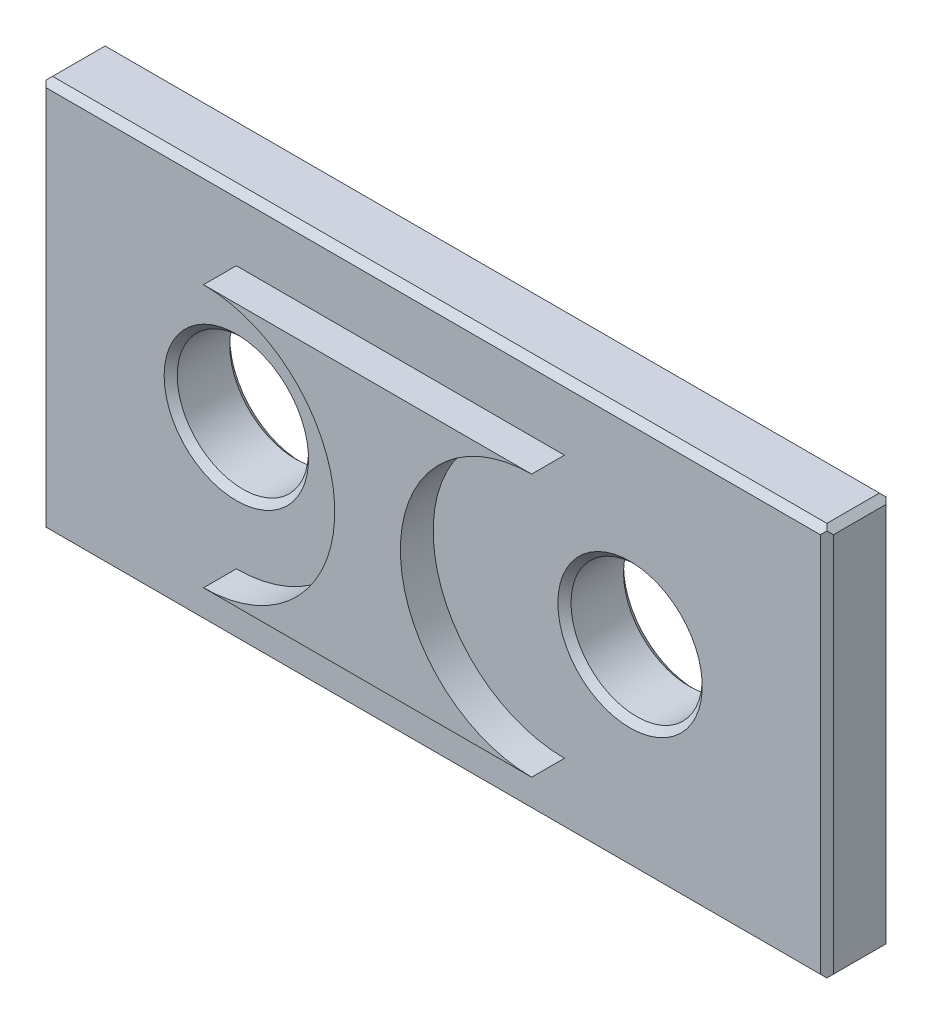
ISO-10303-21;
HEADER;
FILE_DESCRIPTION(('STEP AP214'),'2;1');
FILE_NAME('part.step','',(''),(''),'','','');
FILE_SCHEMA(('AUTOMOTIVE_DESIGN { 1 0 10303 214 1 1 1 1 }'));
ENDSEC;
DATA;
#1=APPLICATION_CONTEXT('core data for automotive mechanical design processes');
#2=APPLICATION_PROTOCOL_DEFINITION('international standard','automotive_design',2000,#1);
#3=PRODUCT_CONTEXT('',#1,'mechanical');
#4=PRODUCT('Part','Part','',(#3));
#5=PRODUCT_RELATED_PRODUCT_CATEGORY('part','',(#4));
#6=PRODUCT_DEFINITION_FORMATION('','',#4);
#7=PRODUCT_DEFINITION_CONTEXT('part definition',#1,'design');
#8=PRODUCT_DEFINITION('design','',#6,#7);
#9=PRODUCT_DEFINITION_SHAPE('','',#8);
#10=(LENGTH_UNIT() NAMED_UNIT(*) SI_UNIT(.MILLI.,.METRE.));
#11=(NAMED_UNIT(*) PLANE_ANGLE_UNIT() SI_UNIT($,.RADIAN.));
#12=(NAMED_UNIT(*) SI_UNIT($,.STERADIAN.) SOLID_ANGLE_UNIT());
#13=UNCERTAINTY_MEASURE_WITH_UNIT(LENGTH_MEASURE(1.E-05),#10,'distance_accuracy_value','');
#14=(GEOMETRIC_REPRESENTATION_CONTEXT(3) GLOBAL_UNCERTAINTY_ASSIGNED_CONTEXT((#13)) GLOBAL_UNIT_ASSIGNED_CONTEXT((#10,
#11,#12)) REPRESENTATION_CONTEXT('',''));
#15=CARTESIAN_POINT('',(0.,0.,0.));
#16=DIRECTION('',(0.,0.,1.));
#17=DIRECTION('',(1.,0.,0.));
#18=AXIS2_PLACEMENT_3D('',#15,#16,#17);
#19=CARTESIAN_POINT('',(0.,60.,10.));
#20=DIRECTION('',(0.,0.,-1.));
#21=DIRECTION('',(-1.,0.,0.));
#22=AXIS2_PLACEMENT_3D('',#19,#20,#21);
#23=PLANE('',#22);
#24=CARTESIAN_POINT('',(30.,30.,10.));
#25=DIRECTION('',(0.,0.,-1.));
#26=DIRECTION('',(-1.,0.,0.));
#27=AXIS2_PLACEMENT_3D('',#24,#25,#26);
#28=CIRCLE('',#27,11.);
#29=CARTESIAN_POINT('',(19.,30.,10.));
#30=VERTEX_POINT('',#29);
#31=EDGE_CURVE('E536',#30,#30,#28,.T.);
#32=ORIENTED_EDGE('',*,*,#31,.T.);
#33=EDGE_LOOP('',(#32));
#34=FACE_BOUND('',#33,.T.);
#35=DIRECTION('',(0.,1.,0.));
#36=VECTOR('',#35,1.);
#37=CARTESIAN_POINT('',(119.,60.,10.));
#38=LINE('',#37,#36);
#39=CARTESIAN_POINT('',(119.,1.,10.));
#40=VERTEX_POINT('',#39);
#41=CARTESIAN_POINT('',(119.,59.,10.));
#42=VERTEX_POINT('',#41);
#43=EDGE_CURVE('E544',#40,#42,#38,.T.);
#44=ORIENTED_EDGE('',*,*,#43,.T.);
#45=DIRECTION('',(-1.,0.,0.));
#46=VECTOR('',#45,1.);
#47=CARTESIAN_POINT('',(0.,59.,10.));
#48=LINE('',#47,#46);
#49=CARTESIAN_POINT('',(0.999999999999999,59.,10.));
#50=VERTEX_POINT('',#49);
#51=EDGE_CURVE('E546',#42,#50,#48,.T.);
#52=ORIENTED_EDGE('',*,*,#51,.T.);
#53=DIRECTION('',(0.,-1.,0.));
#54=VECTOR('',#53,1.);
#55=CARTESIAN_POINT('',(0.999999999999999,60.,10.));
#56=LINE('',#55,#54);
#57=CARTESIAN_POINT('',(0.999999999999999,1.,10.));
#58=VERTEX_POINT('',#57);
#59=EDGE_CURVE('E539',#50,#58,#56,.T.);
#60=ORIENTED_EDGE('',*,*,#59,.T.);
#61=DIRECTION('',(1.,0.,0.));
#62=VECTOR('',#61,1.);
#63=CARTESIAN_POINT('',(0.,1.,10.));
#64=LINE('',#63,#62);
#65=EDGE_CURVE('E542',#58,#40,#64,.T.);
#66=ORIENTED_EDGE('',*,*,#65,.T.);
#67=EDGE_LOOP('',(#44,#52,#60,#66));
#68=FACE_BOUND('',#67,.T.);
#69=CARTESIAN_POINT('',(90.,30.,10.));
#70=DIRECTION('',(0.,0.,-1.));
#71=DIRECTION('',(-1.,0.,0.));
#72=AXIS2_PLACEMENT_3D('',#69,#70,#71);
#73=CIRCLE('',#72,11.);
#74=CARTESIAN_POINT('',(79.,30.,10.));
#75=VERTEX_POINT('',#74);
#76=EDGE_CURVE('E549',#75,#75,#73,.T.);
#77=ORIENTED_EDGE('',*,*,#76,.T.);
#78=EDGE_LOOP('',(#77));
#79=FACE_BOUND('',#78,.T.);
#80=CARTESIAN_POINT('',(30.,30.,10.));
#81=DIRECTION('',(0.,0.,-1.));
#82=DIRECTION('',(-1.,0.,0.));
#83=AXIS2_PLACEMENT_3D('',#80,#81,#82);
#84=CIRCLE('',#83,20.);
#85=CARTESIAN_POINT('',(30.,50.,10.));
#86=VERTEX_POINT('',#85);
#87=CARTESIAN_POINT('',(30.,9.99999999999999,10.));
#88=VERTEX_POINT('',#87);
#89=EDGE_CURVE('E481',#86,#88,#84,.T.);
#90=ORIENTED_EDGE('',*,*,#89,.F.);
#91=DIRECTION('',(-1.,0.,0.));
#92=VECTOR('',#91,1.);
#93=CARTESIAN_POINT('',(30.,50.,10.));
#94=LINE('',#93,#92);
#95=CARTESIAN_POINT('',(80.,50.,10.));
#96=VERTEX_POINT('',#95);
#97=EDGE_CURVE('E483',#96,#86,#94,.T.);
#98=ORIENTED_EDGE('',*,*,#97,.F.);
#99=CARTESIAN_POINT('',(80.,30.,10.));
#100=DIRECTION('',(0.,0.,-1.));
#101=DIRECTION('',(-1.,0.,0.));
#102=AXIS2_PLACEMENT_3D('',#99,#100,#101);
#103=CIRCLE('',#102,20.);
#104=CARTESIAN_POINT('',(80.,10.,10.));
#105=VERTEX_POINT('',#104);
#106=EDGE_CURVE('E369',#105,#96,#103,.T.);
#107=ORIENTED_EDGE('',*,*,#106,.F.);
#108=DIRECTION('',(1.,0.,0.));
#109=VECTOR('',#108,1.);
#110=CARTESIAN_POINT('',(30.,10.,10.));
#111=LINE('',#110,#109);
#112=EDGE_CURVE('E364',#88,#105,#111,.T.);
#113=ORIENTED_EDGE('',*,*,#112,.F.);
#114=EDGE_LOOP('',(#90,#98,#107,#113));
#115=FACE_BOUND('',#114,.T.);
#116=ADVANCED_FACE('F349',(#34,#68,#79,#115),#23,.F.);
#117=CARTESIAN_POINT('',(0.,60.,0.));
#118=DIRECTION('',(0.,0.,-1.));
#119=DIRECTION('',(-1.,0.,0.));
#120=AXIS2_PLACEMENT_3D('',#117,#118,#119);
#121=PLANE('',#120);
#122=CARTESIAN_POINT('',(90.,30.,0.));
#123=DIRECTION('',(0.,0.,-1.));
#124=DIRECTION('',(-1.,0.,0.));
#125=AXIS2_PLACEMENT_3D('',#122,#123,#124);
#126=CIRCLE('',#125,11.);
#127=CARTESIAN_POINT('',(79.,30.,0.));
#128=VERTEX_POINT('',#127);
#129=EDGE_CURVE('E580',#128,#128,#126,.F.);
#130=ORIENTED_EDGE('',*,*,#129,.T.);
#131=EDGE_LOOP('',(#130));
#132=FACE_BOUND('',#131,.T.);
#133=DIRECTION('',(0.,-1.,0.));
#134=VECTOR('',#133,1.);
#135=CARTESIAN_POINT('',(119.,0.,0.));
#136=LINE('',#135,#134);
#137=CARTESIAN_POINT('',(119.,59.,0.));
#138=VERTEX_POINT('',#137);
#139=CARTESIAN_POINT('',(119.,1.,0.));
#140=VERTEX_POINT('',#139);
#141=EDGE_CURVE('E575',#138,#140,#136,.T.);
#142=ORIENTED_EDGE('',*,*,#141,.T.);
#143=DIRECTION('',(-1.,0.,0.));
#144=VECTOR('',#143,1.);
#145=CARTESIAN_POINT('',(0.,1.,0.));
#146=LINE('',#145,#144);
#147=CARTESIAN_POINT('',(1.,1.,0.));
#148=VERTEX_POINT('',#147);
#149=EDGE_CURVE('E577',#140,#148,#146,.T.);
#150=ORIENTED_EDGE('',*,*,#149,.T.);
#151=DIRECTION('',(0.,1.,0.));
#152=VECTOR('',#151,1.);
#153=CARTESIAN_POINT('',(1.,60.,0.));
#154=LINE('',#153,#152);
#155=CARTESIAN_POINT('',(1.,59.,0.));
#156=VERTEX_POINT('',#155);
#157=EDGE_CURVE('E570',#148,#156,#154,.T.);
#158=ORIENTED_EDGE('',*,*,#157,.T.);
#159=DIRECTION('',(1.,0.,0.));
#160=VECTOR('',#159,1.);
#161=CARTESIAN_POINT('',(120.,59.,0.));
#162=LINE('',#161,#160);
#163=EDGE_CURVE('E573',#156,#138,#162,.T.);
#164=ORIENTED_EDGE('',*,*,#163,.T.);
#165=EDGE_LOOP('',(#142,#150,#158,#164));
#166=FACE_BOUND('',#165,.T.);
#167=CARTESIAN_POINT('',(30.,30.,0.));
#168=DIRECTION('',(0.,0.,-1.));
#169=DIRECTION('',(-1.,0.,0.));
#170=AXIS2_PLACEMENT_3D('',#167,#168,#169);
#171=CIRCLE('',#170,11.);
#172=CARTESIAN_POINT('',(19.,30.,0.));
#173=VERTEX_POINT('',#172);
#174=EDGE_CURVE('E567',#173,#173,#171,.F.);
#175=ORIENTED_EDGE('',*,*,#174,.T.);
#176=EDGE_LOOP('',(#175));
#177=FACE_BOUND('',#176,.T.);
#178=ADVANCED_FACE('F724',(#132,#166,#177),#121,.T.);
#179=CARTESIAN_POINT('',(0.,0.,10.));
#180=DIRECTION('',(1.,0.,0.));
#181=DIRECTION('',(0.,0.,-1.));
#182=AXIS2_PLACEMENT_3D('',#179,#180,#181);
#183=PLANE('',#182);
#184=DIRECTION('',(0.,-1.,0.));
#185=VECTOR('',#184,1.);
#186=CARTESIAN_POINT('',(0.,0.,1.));
#187=LINE('',#186,#185);
#188=CARTESIAN_POINT('',(0.,59.,1.));
#189=VERTEX_POINT('',#188);
#190=CARTESIAN_POINT('',(0.,1.,1.));
#191=VERTEX_POINT('',#190);
#192=EDGE_CURVE('E595',#189,#191,#187,.T.);
#193=ORIENTED_EDGE('',*,*,#192,.T.);
#194=DIRECTION('',(0.,0.,1.));
#195=VECTOR('',#194,1.);
#196=CARTESIAN_POINT('',(0.,1.,10.));
#197=LINE('',#196,#195);
#198=CARTESIAN_POINT('',(0.,1.00000000000001,8.99999999999999));
#199=VERTEX_POINT('',#198);
#200=EDGE_CURVE('E617',#191,#199,#197,.T.);
#201=ORIENTED_EDGE('',*,*,#200,.T.);
#202=DIRECTION('',(0.,1.,0.));
#203=VECTOR('',#202,1.);
#204=CARTESIAN_POINT('',(0.,0.,9.));
#205=LINE('',#204,#203);
#206=CARTESIAN_POINT('',(0.,59.,9.));
#207=VERTEX_POINT('',#206);
#208=EDGE_CURVE('E561',#199,#207,#205,.T.);
#209=ORIENTED_EDGE('',*,*,#208,.T.);
#210=DIRECTION('',(0.,0.,-1.));
#211=VECTOR('',#210,1.);
#212=CARTESIAN_POINT('',(0.,59.,10.));
#213=LINE('',#212,#211);
#214=EDGE_CURVE('E614',#207,#189,#213,.T.);
#215=ORIENTED_EDGE('',*,*,#214,.T.);
#216=EDGE_LOOP('',(#193,#201,#209,#215));
#217=FACE_BOUND('',#216,.T.);
#218=ADVANCED_FACE('F351',(#217),#183,.F.);
#219=CARTESIAN_POINT('',(0.,0.,10.));
#220=DIRECTION('',(0.,1.,0.));
#221=DIRECTION('',(0.,0.,1.));
#222=AXIS2_PLACEMENT_3D('',#219,#220,#221);
#223=PLANE('',#222);
#224=DIRECTION('',(-1.,0.,0.));
#225=VECTOR('',#224,1.);
#226=CARTESIAN_POINT('',(0.,0.,9.));
#227=LINE('',#226,#225);
#228=CARTESIAN_POINT('',(119.,0.,9.));
#229=VERTEX_POINT('',#228);
#230=CARTESIAN_POINT('',(1.,0.,9.));
#231=VERTEX_POINT('',#230);
#232=EDGE_CURVE('E558',#229,#231,#227,.T.);
#233=ORIENTED_EDGE('',*,*,#232,.T.);
#234=DIRECTION('',(0.,0.,-1.));
#235=VECTOR('',#234,1.);
#236=CARTESIAN_POINT('',(1.,0.,10.));
#237=LINE('',#236,#235);
#238=CARTESIAN_POINT('',(0.999999999999991,0.,0.999999999999999));
#239=VERTEX_POINT('',#238);
#240=EDGE_CURVE('E603',#231,#239,#237,.T.);
#241=ORIENTED_EDGE('',*,*,#240,.T.);
#242=DIRECTION('',(1.,0.,0.));
#243=VECTOR('',#242,1.);
#244=CARTESIAN_POINT('',(120.,0.,1.));
#245=LINE('',#244,#243);
#246=CARTESIAN_POINT('',(119.,0.,1.));
#247=VERTEX_POINT('',#246);
#248=EDGE_CURVE('E586',#239,#247,#245,.T.);
#249=ORIENTED_EDGE('',*,*,#248,.T.);
#250=DIRECTION('',(0.,0.,1.));
#251=VECTOR('',#250,1.);
#252=CARTESIAN_POINT('',(119.,0.,10.));
#253=LINE('',#252,#251);
#254=EDGE_CURVE('E601',#247,#229,#253,.T.);
#255=ORIENTED_EDGE('',*,*,#254,.T.);
#256=EDGE_LOOP('',(#233,#241,#249,#255));
#257=FACE_BOUND('',#256,.T.);
#258=ADVANCED_FACE('F686',(#257),#223,.F.);
#259=CARTESIAN_POINT('',(120.,0.,10.));
#260=DIRECTION('',(-1.,0.,0.));
#261=DIRECTION('',(0.,0.,1.));
#262=AXIS2_PLACEMENT_3D('',#259,#260,#261);
#263=PLANE('',#262);
#264=DIRECTION('',(0.,-1.,0.));
#265=VECTOR('',#264,1.);
#266=CARTESIAN_POINT('',(120.,0.,9.));
#267=LINE('',#266,#265);
#268=CARTESIAN_POINT('',(120.,59.,9.));
#269=VERTEX_POINT('',#268);
#270=CARTESIAN_POINT('',(120.,1.00000000000001,8.99999999999999));
#271=VERTEX_POINT('',#270);
#272=EDGE_CURVE('E555',#269,#271,#267,.T.);
#273=ORIENTED_EDGE('',*,*,#272,.T.);
#274=DIRECTION('',(0.,0.,-1.));
#275=VECTOR('',#274,1.);
#276=CARTESIAN_POINT('',(120.,1.,10.));
#277=LINE('',#276,#275);
#278=CARTESIAN_POINT('',(120.,0.999999999999992,0.999999999999999));
#279=VERTEX_POINT('',#278);
#280=EDGE_CURVE('E629',#271,#279,#277,.T.);
#281=ORIENTED_EDGE('',*,*,#280,.T.);
#282=DIRECTION('',(0.,1.,0.));
#283=VECTOR('',#282,1.);
#284=CARTESIAN_POINT('',(120.,60.,1.));
#285=LINE('',#284,#283);
#286=CARTESIAN_POINT('',(120.,59.,1.));
#287=VERTEX_POINT('',#286);
#288=EDGE_CURVE('E589',#279,#287,#285,.T.);
#289=ORIENTED_EDGE('',*,*,#288,.T.);
#290=DIRECTION('',(0.,0.,1.));
#291=VECTOR('',#290,1.);
#292=CARTESIAN_POINT('',(120.,59.,10.));
#293=LINE('',#292,#291);
#294=EDGE_CURVE('E627',#287,#269,#293,.T.);
#295=ORIENTED_EDGE('',*,*,#294,.T.);
#296=EDGE_LOOP('',(#273,#281,#289,#295));
#297=FACE_BOUND('',#296,.T.);
#298=ADVANCED_FACE('F705',(#297),#263,.F.);
#299=CARTESIAN_POINT('',(0.,60.,10.));
#300=DIRECTION('',(0.,-1.,0.));
#301=DIRECTION('',(0.,0.,-1.));
#302=AXIS2_PLACEMENT_3D('',#299,#300,#301);
#303=PLANE('',#302);
#304=DIRECTION('',(1.,0.,0.));
#305=VECTOR('',#304,1.);
#306=CARTESIAN_POINT('',(0.,60.,9.));
#307=LINE('',#306,#305);
#308=CARTESIAN_POINT('',(1.00000000000001,60.,9.));
#309=VERTEX_POINT('',#308);
#310=CARTESIAN_POINT('',(119.,60.,9.));
#311=VERTEX_POINT('',#310);
#312=EDGE_CURVE('E552',#309,#311,#307,.T.);
#313=ORIENTED_EDGE('',*,*,#312,.T.);
#314=DIRECTION('',(0.,0.,-1.));
#315=VECTOR('',#314,1.);
#316=CARTESIAN_POINT('',(119.,60.,10.));
#317=LINE('',#316,#315);
#318=CARTESIAN_POINT('',(119.,60.,1.));
#319=VERTEX_POINT('',#318);
#320=EDGE_CURVE('E642',#311,#319,#317,.T.);
#321=ORIENTED_EDGE('',*,*,#320,.T.);
#322=DIRECTION('',(-1.,0.,0.));
#323=VECTOR('',#322,1.);
#324=CARTESIAN_POINT('',(0.,60.,1.));
#325=LINE('',#324,#323);
#326=CARTESIAN_POINT('',(1.00000000000001,60.,1.));
#327=VERTEX_POINT('',#326);
#328=EDGE_CURVE('E592',#319,#327,#325,.T.);
#329=ORIENTED_EDGE('',*,*,#328,.T.);
#330=DIRECTION('',(0.,0.,1.));
#331=VECTOR('',#330,1.);
#332=CARTESIAN_POINT('',(1.00000000000001,60.,10.));
#333=LINE('',#332,#331);
#334=EDGE_CURVE('E640',#327,#309,#333,.T.);
#335=ORIENTED_EDGE('',*,*,#334,.T.);
#336=EDGE_LOOP('',(#313,#321,#329,#335));
#337=FACE_BOUND('',#336,.T.);
#338=ADVANCED_FACE('F719',(#337),#303,.F.);
#339=CARTESIAN_POINT('',(30.,30.,10.));
#340=DIRECTION('',(0.,0.,-1.));
#341=DIRECTION('',(-1.,0.,0.));
#342=AXIS2_PLACEMENT_3D('',#339,#340,#341);
#343=CYLINDRICAL_SURFACE('',#342,10.);
#344=CARTESIAN_POINT('',(30.,30.,1.00000000000001));
#345=DIRECTION('',(0.,0.,-1.));
#346=DIRECTION('',(-1.,0.,0.));
#347=AXIS2_PLACEMENT_3D('',#344,#345,#346);
#348=CIRCLE('',#347,10.);
#349=CARTESIAN_POINT('',(20.,30.,1.00000000000001));
#350=VERTEX_POINT('',#349);
#351=EDGE_CURVE('E598',#350,#350,#348,.T.);
#352=ORIENTED_EDGE('',*,*,#351,.T.);
#353=EDGE_LOOP('',(#352));
#354=FACE_BOUND('',#353,.T.);
#355=CARTESIAN_POINT('',(30.,30.,9.));
#356=DIRECTION('',(0.,0.,-1.));
#357=DIRECTION('',(-1.,0.,0.));
#358=AXIS2_PLACEMENT_3D('',#355,#356,#357);
#359=CIRCLE('',#358,10.);
#360=CARTESIAN_POINT('',(20.,30.,9.));
#361=VERTEX_POINT('',#360);
#362=EDGE_CURVE('E564',#361,#361,#359,.F.);
#363=ORIENTED_EDGE('',*,*,#362,.T.);
#364=EDGE_LOOP('',(#363));
#365=FACE_BOUND('',#364,.T.);
#366=ADVANCED_FACE('F756',(#354,#365),#343,.F.);
#367=CARTESIAN_POINT('',(90.,30.,10.));
#368=DIRECTION('',(0.,0.,-1.));
#369=DIRECTION('',(-1.,0.,0.));
#370=AXIS2_PLACEMENT_3D('',#367,#368,#369);
#371=CYLINDRICAL_SURFACE('',#370,10.);
#372=CARTESIAN_POINT('',(90.,30.,0.999999999999999));
#373=DIRECTION('',(0.,0.,-1.));
#374=DIRECTION('',(-1.,0.,0.));
#375=AXIS2_PLACEMENT_3D('',#372,#373,#374);
#376=CIRCLE('',#375,10.);
#377=CARTESIAN_POINT('',(80.,30.,0.999999999999999));
#378=VERTEX_POINT('',#377);
#379=EDGE_CURVE('E583',#378,#378,#376,.T.);
#380=ORIENTED_EDGE('',*,*,#379,.T.);
#381=EDGE_LOOP('',(#380));
#382=FACE_BOUND('',#381,.T.);
#383=CARTESIAN_POINT('',(90.,30.,9.));
#384=DIRECTION('',(0.,0.,-1.));
#385=DIRECTION('',(-1.,0.,0.));
#386=AXIS2_PLACEMENT_3D('',#383,#384,#385);
#387=CIRCLE('',#386,10.);
#388=CARTESIAN_POINT('',(80.,30.,9.));
#389=VERTEX_POINT('',#388);
#390=EDGE_CURVE('E533',#389,#389,#387,.F.);
#391=ORIENTED_EDGE('',*,*,#390,.T.);
#392=EDGE_LOOP('',(#391));
#393=FACE_BOUND('',#392,.T.);
#394=ADVANCED_FACE('F784',(#382,#393),#371,.F.);
#395=CARTESIAN_POINT('',(90.,30.,9.));
#396=DIRECTION('',(0.,0.,1.));
#397=DIRECTION('',(1.,0.,0.));
#398=AXIS2_PLACEMENT_3D('',#395,#396,#397);
#399=CONICAL_SURFACE('',#398,10.,0.785398163397449);
#400=ORIENTED_EDGE('',*,*,#76,.F.);
#401=EDGE_LOOP('',(#400));
#402=FACE_BOUND('',#401,.T.);
#403=ORIENTED_EDGE('',*,*,#390,.F.);
#404=EDGE_LOOP('',(#403));
#405=FACE_BOUND('',#404,.T.);
#406=ADVANCED_FACE('F791',(#402,#405),#399,.F.);
#407=CARTESIAN_POINT('',(0.,1.,10.));
#408=DIRECTION('',(0.,0.707106781186548,-0.707106781186547));
#409=DIRECTION('',(0.,0.707106781186547,0.707106781186548));
#410=AXIS2_PLACEMENT_3D('',#407,#408,#409);
#411=PLANE('',#410);
#412=DIRECTION('',(0.577350269189625,0.577350269189626,0.577350269189627));
#413=VECTOR('',#412,1.);
#414=CARTESIAN_POINT('',(20.6666666666666,20.6666666666667,29.6666666666667));
#415=LINE('',#414,#413);
#416=CARTESIAN_POINT('',(0.499999999999997,0.499999999999997,9.5));
#417=VERTEX_POINT('',#416);
#418=EDGE_CURVE('E528',#417,#58,#415,.T.);
#419=ORIENTED_EDGE('',*,*,#418,.F.);
#420=DIRECTION('',(0.577350269189624,-0.577350269189626,-0.577350269189627));
#421=VECTOR('',#420,1.);
#422=CARTESIAN_POINT('',(0.,1.,10.));
#423=LINE('',#422,#421);
#424=EDGE_CURVE('E625',#417,#231,#423,.T.);
#425=ORIENTED_EDGE('',*,*,#424,.T.);
#426=ORIENTED_EDGE('',*,*,#232,.F.);
#427=DIRECTION('',(0.577350269189625,0.577350269189626,0.577350269189626));
#428=VECTOR('',#427,1.);
#429=CARTESIAN_POINT('',(80.0000000000001,-38.9999999999999,-30.));
#430=LINE('',#429,#428);
#431=CARTESIAN_POINT('',(119.5,0.500000000000002,9.49999999999999));
#432=VERTEX_POINT('',#431);
#433=EDGE_CURVE('E623',#229,#432,#430,.T.);
#434=ORIENTED_EDGE('',*,*,#433,.T.);
#435=DIRECTION('',(-0.577350269189625,0.577350269189625,0.577350269189626));
#436=VECTOR('',#435,1.);
#437=CARTESIAN_POINT('',(79.3333333333334,40.6666666666666,49.6666666666667));
#438=LINE('',#437,#436);
#439=EDGE_CURVE('E530',#40,#432,#438,.F.);
#440=ORIENTED_EDGE('',*,*,#439,.F.);
#441=ORIENTED_EDGE('',*,*,#65,.F.);
#442=EDGE_LOOP('',(#419,#425,#426,#434,#440,#441));
#443=FACE_BOUND('',#442,.T.);
#444=ADVANCED_FACE('F681',(#443),#411,.F.);
#445=CARTESIAN_POINT('',(119.,60.,10.));
#446=DIRECTION('',(-0.707106781186548,0.,-0.707106781186547));
#447=DIRECTION('',(-0.707106781186547,0.,0.707106781186548));
#448=AXIS2_PLACEMENT_3D('',#445,#446,#447);
#449=PLANE('',#448);
#450=ORIENTED_EDGE('',*,*,#439,.T.);
#451=DIRECTION('',(0.577350269189625,0.577350269189626,-0.577350269189626));
#452=VECTOR('',#451,1.);
#453=CARTESIAN_POINT('',(139.,20.,-10.));
#454=LINE('',#453,#452);
#455=EDGE_CURVE('E638',#432,#271,#454,.T.);
#456=ORIENTED_EDGE('',*,*,#455,.T.);
#457=ORIENTED_EDGE('',*,*,#272,.F.);
#458=DIRECTION('',(-0.577350269189625,0.577350269189625,0.577350269189626));
#459=VECTOR('',#458,1.);
#460=CARTESIAN_POINT('',(119.,60.,10.));
#461=LINE('',#460,#459);
#462=CARTESIAN_POINT('',(119.5,59.5,9.5));
#463=VERTEX_POINT('',#462);
#464=EDGE_CURVE('E636',#269,#463,#461,.T.);
#465=ORIENTED_EDGE('',*,*,#464,.T.);
#466=DIRECTION('',(-0.577350269189625,-0.577350269189625,0.577350269189626));
#467=VECTOR('',#466,1.);
#468=CARTESIAN_POINT('',(119.333333333333,59.3333333333333,9.66666666666667));
#469=LINE('',#468,#467);
#470=EDGE_CURVE('E525',#42,#463,#469,.F.);
#471=ORIENTED_EDGE('',*,*,#470,.F.);
#472=ORIENTED_EDGE('',*,*,#43,.F.);
#473=EDGE_LOOP('',(#450,#456,#457,#465,#471,#472));
#474=FACE_BOUND('',#473,.T.);
#475=ADVANCED_FACE('F700',(#474),#449,.F.);
#476=CARTESIAN_POINT('',(0.999999999999999,60.,10.));
#477=DIRECTION('',(0.707106781186549,0.,-0.707106781186546));
#478=DIRECTION('',(-0.707106781186546,0.,-0.707106781186549));
#479=AXIS2_PLACEMENT_3D('',#476,#477,#478);
#480=PLANE('',#479);
#481=ORIENTED_EDGE('',*,*,#208,.F.);
#482=DIRECTION('',(0.577350269189625,-0.577350269189626,0.577350269189626));
#483=VECTOR('',#482,1.);
#484=CARTESIAN_POINT('',(-19.,20.,-10.));
#485=LINE('',#484,#483);
#486=EDGE_CURVE('E621',#199,#417,#485,.T.);
#487=ORIENTED_EDGE('',*,*,#486,.T.);
#488=ORIENTED_EDGE('',*,*,#418,.T.);
#489=ORIENTED_EDGE('',*,*,#59,.F.);
#490=DIRECTION('',(-0.577350269189625,0.577350269189626,-0.577350269189627));
#491=VECTOR('',#490,1.);
#492=CARTESIAN_POINT('',(0.666666666666666,59.3333333333333,9.66666666666667));
#493=LINE('',#492,#491);
#494=CARTESIAN_POINT('',(0.5,59.5,9.5));
#495=VERTEX_POINT('',#494);
#496=EDGE_CURVE('E523',#495,#50,#493,.F.);
#497=ORIENTED_EDGE('',*,*,#496,.F.);
#498=DIRECTION('',(-0.577350269189628,-0.57735026918962,-0.57735026918963));
#499=VECTOR('',#498,1.);
#500=CARTESIAN_POINT('',(1.,60.,10.));
#501=LINE('',#500,#499);
#502=EDGE_CURVE('E619',#495,#207,#501,.T.);
#503=ORIENTED_EDGE('',*,*,#502,.T.);
#504=EDGE_LOOP('',(#481,#487,#488,#489,#497,#503));
#505=FACE_BOUND('',#504,.T.);
#506=ADVANCED_FACE('F660',(#505),#480,.F.);
#507=CARTESIAN_POINT('',(0.,59.,10.));
#508=DIRECTION('',(0.,-0.707106781186548,-0.707106781186547));
#509=DIRECTION('',(0.,0.707106781186547,-0.707106781186548));
#510=AXIS2_PLACEMENT_3D('',#507,#508,#509);
#511=PLANE('',#510);
#512=ORIENTED_EDGE('',*,*,#470,.T.);
#513=DIRECTION('',(-0.577350269189625,0.577350269189625,-0.577350269189626));
#514=VECTOR('',#513,1.);
#515=CARTESIAN_POINT('',(80.,98.9999999999999,-30.));
#516=LINE('',#515,#514);
#517=EDGE_CURVE('E11',#463,#311,#516,.T.);
#518=ORIENTED_EDGE('',*,*,#517,.T.);
#519=ORIENTED_EDGE('',*,*,#312,.F.);
#520=DIRECTION('',(-0.577350269189631,-0.577350269189623,0.577350269189624));
#521=VECTOR('',#520,1.);
#522=CARTESIAN_POINT('',(0.,59.,10.));
#523=LINE('',#522,#521);
#524=EDGE_CURVE('E357',#309,#495,#523,.T.);
#525=ORIENTED_EDGE('',*,*,#524,.T.);
#526=ORIENTED_EDGE('',*,*,#496,.T.);
#527=ORIENTED_EDGE('',*,*,#51,.F.);
#528=EDGE_LOOP('',(#512,#518,#519,#525,#526,#527));
#529=FACE_BOUND('',#528,.T.);
#530=ADVANCED_FACE('F652',(#529),#511,.F.);
#531=CARTESIAN_POINT('',(30.,30.,9.));
#532=DIRECTION('',(0.,0.,1.));
#533=DIRECTION('',(1.,0.,0.));
#534=AXIS2_PLACEMENT_3D('',#531,#532,#533);
#535=CONICAL_SURFACE('',#534,10.,0.78539816339745);
#536=ORIENTED_EDGE('',*,*,#31,.F.);
#537=EDGE_LOOP('',(#536));
#538=FACE_BOUND('',#537,.T.);
#539=ORIENTED_EDGE('',*,*,#362,.F.);
#540=EDGE_LOOP('',(#539));
#541=FACE_BOUND('',#540,.T.);
#542=ADVANCED_FACE('F824',(#538,#541),#535,.F.);
#543=CARTESIAN_POINT('',(90.,30.,0.));
#544=DIRECTION('',(0.,0.,-1.));
#545=DIRECTION('',(-1.,0.,0.));
#546=AXIS2_PLACEMENT_3D('',#543,#544,#545);
#547=CONICAL_SURFACE('',#546,11.,0.785398163397449);
#548=ORIENTED_EDGE('',*,*,#379,.F.);
#549=EDGE_LOOP('',(#548));
#550=FACE_BOUND('',#549,.T.);
#551=ORIENTED_EDGE('',*,*,#129,.F.);
#552=EDGE_LOOP('',(#551));
#553=FACE_BOUND('',#552,.T.);
#554=ADVANCED_FACE('F831',(#550,#553),#547,.F.);
#555=CARTESIAN_POINT('',(0.,60.,1.));
#556=DIRECTION('',(0.,0.707106781186547,-0.707106781186547));
#557=DIRECTION('',(0.,0.707106781186548,0.707106781186548));
#558=AXIS2_PLACEMENT_3D('',#555,#556,#557);
#559=PLANE('',#558);
#560=ORIENTED_EDGE('',*,*,#328,.F.);
#561=DIRECTION('',(-0.577350269189626,0.577350269189626,0.577350269189626));
#562=VECTOR('',#561,1.);
#563=CARTESIAN_POINT('',(79.3333333333333,99.6666666666667,40.6666666666667));
#564=LINE('',#563,#562);
#565=CARTESIAN_POINT('',(119.5,59.5,0.500000000000016));
#566=VERTEX_POINT('',#565);
#567=EDGE_CURVE('E647',#319,#566,#564,.F.);
#568=ORIENTED_EDGE('',*,*,#567,.T.);
#569=DIRECTION('',(-0.577350269189626,-0.577350269189626,-0.577350269189626));
#570=VECTOR('',#569,1.);
#571=CARTESIAN_POINT('',(80.,20.,-39.));
#572=LINE('',#571,#570);
#573=EDGE_CURVE('E518',#138,#566,#572,.F.);
#574=ORIENTED_EDGE('',*,*,#573,.F.);
#575=ORIENTED_EDGE('',*,*,#163,.F.);
#576=DIRECTION('',(0.577350269189627,-0.577350269189625,-0.577350269189625));
#577=VECTOR('',#576,1.);
#578=CARTESIAN_POINT('',(20.,40.,-19.));
#579=LINE('',#578,#577);
#580=CARTESIAN_POINT('',(0.500000000000004,59.5,0.499999999999997));
#581=VERTEX_POINT('',#580);
#582=EDGE_CURVE('E521',#581,#156,#579,.T.);
#583=ORIENTED_EDGE('',*,*,#582,.F.);
#584=DIRECTION('',(-0.577350269189631,-0.577350269189623,-0.577350269189623));
#585=VECTOR('',#584,1.);
#586=CARTESIAN_POINT('',(0.666666666666665,59.6666666666667,0.666666666666664));
#587=LINE('',#586,#585);
#588=EDGE_CURVE('E645',#581,#327,#587,.F.);
#589=ORIENTED_EDGE('',*,*,#588,.T.);
#590=EDGE_LOOP('',(#560,#568,#574,#575,#583,#589));
#591=FACE_BOUND('',#590,.T.);
#592=ADVANCED_FACE('F721',(#591),#559,.T.);
#593=CARTESIAN_POINT('',(0.,0.,1.));
#594=DIRECTION('',(-0.707106781186547,0.,-0.707106781186549));
#595=DIRECTION('',(-0.707106781186549,0.,0.707106781186547));
#596=AXIS2_PLACEMENT_3D('',#593,#594,#595);
#597=PLANE('',#596);
#598=DIRECTION('',(-0.577350269189627,-0.577350269189625,0.577350269189625));
#599=VECTOR('',#598,1.);
#600=CARTESIAN_POINT('',(0.,0.,1.));
#601=LINE('',#600,#599);
#602=CARTESIAN_POINT('',(0.500000000000002,0.5,0.500000000000001));
#603=VERTEX_POINT('',#602);
#604=EDGE_CURVE('E516',#603,#148,#601,.F.);
#605=ORIENTED_EDGE('',*,*,#604,.F.);
#606=DIRECTION('',(0.577350269189626,-0.577350269189628,-0.577350269189624));
#607=VECTOR('',#606,1.);
#608=CARTESIAN_POINT('',(0.333333333333335,0.666666666666667,0.666666666666666));
#609=LINE('',#608,#607);
#610=EDGE_CURVE('E612',#603,#191,#609,.F.);
#611=ORIENTED_EDGE('',*,*,#610,.T.);
#612=ORIENTED_EDGE('',*,*,#192,.F.);
#613=DIRECTION('',(-0.577350269189629,-0.577350269189621,0.577350269189627));
#614=VECTOR('',#613,1.);
#615=CARTESIAN_POINT('',(-19.6666666666666,39.3333333333336,20.6666666666666));
#616=LINE('',#615,#614);
#617=EDGE_CURVE('E610',#189,#581,#616,.F.);
#618=ORIENTED_EDGE('',*,*,#617,.T.);
#619=ORIENTED_EDGE('',*,*,#582,.T.);
#620=ORIENTED_EDGE('',*,*,#157,.F.);
#621=EDGE_LOOP('',(#605,#611,#612,#618,#619,#620));
#622=FACE_BOUND('',#621,.T.);
#623=ADVANCED_FACE('F669',(#622),#597,.T.);
#624=CARTESIAN_POINT('',(120.,0.,1.));
#625=DIRECTION('',(0.707106781186547,0.,-0.707106781186547));
#626=DIRECTION('',(-0.707106781186548,0.,-0.707106781186548));
#627=AXIS2_PLACEMENT_3D('',#624,#625,#626);
#628=PLANE('',#627);
#629=ORIENTED_EDGE('',*,*,#288,.F.);
#630=DIRECTION('',(0.577350269189626,0.577350269189626,0.577350269189626));
#631=VECTOR('',#630,1.);
#632=CARTESIAN_POINT('',(119.666666666667,0.666666666666667,0.666666666666667));
#633=LINE('',#632,#631);
#634=CARTESIAN_POINT('',(119.5,0.500000000000008,0.499999999999993));
#635=VERTEX_POINT('',#634);
#636=EDGE_CURVE('E634',#279,#635,#633,.F.);
#637=ORIENTED_EDGE('',*,*,#636,.T.);
#638=DIRECTION('',(-0.577350269189626,0.577350269189626,-0.577350269189626));
#639=VECTOR('',#638,1.);
#640=CARTESIAN_POINT('',(120.,0.,1.));
#641=LINE('',#640,#639);
#642=EDGE_CURVE('E513',#140,#635,#641,.F.);
#643=ORIENTED_EDGE('',*,*,#642,.F.);
#644=ORIENTED_EDGE('',*,*,#141,.F.);
#645=ORIENTED_EDGE('',*,*,#573,.T.);
#646=DIRECTION('',(-0.577350269189626,0.577350269189626,-0.577350269189626));
#647=VECTOR('',#646,1.);
#648=CARTESIAN_POINT('',(139.666666666667,39.3333333333333,20.6666666666667));
#649=LINE('',#648,#647);
#650=EDGE_CURVE('E632',#566,#287,#649,.F.);
#651=ORIENTED_EDGE('',*,*,#650,.T.);
#652=EDGE_LOOP('',(#629,#637,#643,#644,#645,#651));
#653=FACE_BOUND('',#652,.T.);
#654=ADVANCED_FACE('F708',(#653),#628,.T.);
#655=CARTESIAN_POINT('',(0.,0.,1.));
#656=DIRECTION('',(0.,-0.707106781186547,-0.707106781186547));
#657=DIRECTION('',(0.,0.707106781186548,-0.707106781186548));
#658=AXIS2_PLACEMENT_3D('',#655,#656,#657);
#659=PLANE('',#658);
#660=ORIENTED_EDGE('',*,*,#248,.F.);
#661=DIRECTION('',(0.577350269189625,-0.577350269189626,0.577350269189626));
#662=VECTOR('',#661,1.);
#663=CARTESIAN_POINT('',(0.666666666666668,0.333333333333333,0.666666666666668));
#664=LINE('',#663,#662);
#665=EDGE_CURVE('E608',#239,#603,#664,.F.);
#666=ORIENTED_EDGE('',*,*,#665,.T.);
#667=ORIENTED_EDGE('',*,*,#604,.T.);
#668=ORIENTED_EDGE('',*,*,#149,.F.);
#669=ORIENTED_EDGE('',*,*,#642,.T.);
#670=DIRECTION('',(0.577350269189626,0.577350269189626,-0.577350269189626));
#671=VECTOR('',#670,1.);
#672=CARTESIAN_POINT('',(79.3333333333333,-39.6666666666667,40.6666666666667));
#673=LINE('',#672,#671);
#674=EDGE_CURVE('E606',#635,#247,#673,.F.);
#675=ORIENTED_EDGE('',*,*,#674,.T.);
#676=EDGE_LOOP('',(#660,#666,#667,#668,#669,#675));
#677=FACE_BOUND('',#676,.T.);
#678=ADVANCED_FACE('F689',(#677),#659,.T.);
#679=CARTESIAN_POINT('',(30.,30.,0.));
#680=DIRECTION('',(0.,0.,-1.));
#681=DIRECTION('',(-1.,0.,0.));
#682=AXIS2_PLACEMENT_3D('',#679,#680,#681);
#683=CONICAL_SURFACE('',#682,11.,0.785398163397446);
#684=ORIENTED_EDGE('',*,*,#351,.F.);
#685=EDGE_LOOP('',(#684));
#686=FACE_BOUND('',#685,.T.);
#687=ORIENTED_EDGE('',*,*,#174,.F.);
#688=EDGE_LOOP('',(#687));
#689=FACE_BOUND('',#688,.T.);
#690=ADVANCED_FACE('F731',(#686,#689),#683,.F.);
#691=CARTESIAN_POINT('',(1.,0.,10.));
#692=DIRECTION('',(0.707106781186549,0.707106781186546,0.));
#693=DIRECTION('',(-0.707106781186546,0.707106781186549,0.));
#694=AXIS2_PLACEMENT_3D('',#691,#692,#693);
#695=PLANE('',#694);
#696=ORIENTED_EDGE('',*,*,#486,.F.);
#697=ORIENTED_EDGE('',*,*,#200,.F.);
#698=ORIENTED_EDGE('',*,*,#610,.F.);
#699=ORIENTED_EDGE('',*,*,#665,.F.);
#700=ORIENTED_EDGE('',*,*,#240,.F.);
#701=ORIENTED_EDGE('',*,*,#424,.F.);
#702=EDGE_LOOP('',(#696,#697,#698,#699,#700,#701));
#703=FACE_BOUND('',#702,.T.);
#704=ADVANCED_FACE('F675',(#703),#695,.F.);
#705=CARTESIAN_POINT('',(120.,1.,10.));
#706=DIRECTION('',(-0.707106781186548,0.707106781186547,0.));
#707=DIRECTION('',(-0.707106781186547,-0.707106781186548,0.));
#708=AXIS2_PLACEMENT_3D('',#705,#706,#707);
#709=PLANE('',#708);
#710=ORIENTED_EDGE('',*,*,#433,.F.);
#711=ORIENTED_EDGE('',*,*,#254,.F.);
#712=ORIENTED_EDGE('',*,*,#674,.F.);
#713=ORIENTED_EDGE('',*,*,#636,.F.);
#714=ORIENTED_EDGE('',*,*,#280,.F.);
#715=ORIENTED_EDGE('',*,*,#455,.F.);
#716=EDGE_LOOP('',(#710,#711,#712,#713,#714,#715));
#717=FACE_BOUND('',#716,.T.);
#718=ADVANCED_FACE('F695',(#717),#709,.F.);
#719=CARTESIAN_POINT('',(119.,60.,10.));
#720=DIRECTION('',(-0.707106781186547,-0.707106781186547,0.));
#721=DIRECTION('',(0.707106781186548,-0.707106781186548,0.));
#722=AXIS2_PLACEMENT_3D('',#719,#720,#721);
#723=PLANE('',#722);
#724=ORIENTED_EDGE('',*,*,#464,.F.);
#725=ORIENTED_EDGE('',*,*,#294,.F.);
#726=ORIENTED_EDGE('',*,*,#650,.F.);
#727=ORIENTED_EDGE('',*,*,#567,.F.);
#728=ORIENTED_EDGE('',*,*,#320,.F.);
#729=ORIENTED_EDGE('',*,*,#517,.F.);
#730=EDGE_LOOP('',(#724,#725,#726,#727,#728,#729));
#731=FACE_BOUND('',#730,.T.);
#732=ADVANCED_FACE('F714',(#731),#723,.F.);
#733=CARTESIAN_POINT('',(0.,59.,10.));
#734=DIRECTION('',(0.707106781186543,-0.707106781186552,0.));
#735=DIRECTION('',(0.707106781186552,0.707106781186543,0.));
#736=AXIS2_PLACEMENT_3D('',#733,#734,#735);
#737=PLANE('',#736);
#738=ORIENTED_EDGE('',*,*,#524,.F.);
#739=ORIENTED_EDGE('',*,*,#334,.F.);
#740=ORIENTED_EDGE('',*,*,#588,.F.);
#741=ORIENTED_EDGE('',*,*,#617,.F.);
#742=ORIENTED_EDGE('',*,*,#214,.F.);
#743=ORIENTED_EDGE('',*,*,#502,.F.);
#744=EDGE_LOOP('',(#738,#739,#740,#741,#742,#743));
#745=FACE_BOUND('',#744,.T.);
#746=ADVANCED_FACE('F662',(#745),#737,.F.);
#747=CARTESIAN_POINT('',(30.,30.,15.));
#748=DIRECTION('',(0.,0.,-1.));
#749=DIRECTION('',(-1.,0.,0.));
#750=AXIS2_PLACEMENT_3D('',#747,#748,#749);
#751=CYLINDRICAL_SURFACE('',#750,20.);
#752=ORIENTED_EDGE('',*,*,#89,.T.);
#753=DIRECTION('',(0.,0.,-1.));
#754=VECTOR('',#753,1.);
#755=CARTESIAN_POINT('',(30.,10.,15.));
#756=LINE('',#755,#754);
#757=CARTESIAN_POINT('',(30.,10.,15.));
#758=VERTEX_POINT('',#757);
#759=EDGE_CURVE('E511',#758,#88,#756,.T.);
#760=ORIENTED_EDGE('',*,*,#759,.F.);
#761=CARTESIAN_POINT('',(30.,30.,15.));
#762=DIRECTION('',(0.,0.,-1.));
#763=DIRECTION('',(-1.,0.,0.));
#764=AXIS2_PLACEMENT_3D('',#761,#762,#763);
#765=CIRCLE('',#764,20.);
#766=CARTESIAN_POINT('',(30.,50.,15.));
#767=VERTEX_POINT('',#766);
#768=EDGE_CURVE('E497',#767,#758,#765,.T.);
#769=ORIENTED_EDGE('',*,*,#768,.F.);
#770=DIRECTION('',(0.,0.,-1.));
#771=VECTOR('',#770,1.);
#772=CARTESIAN_POINT('',(30.,50.,15.));
#773=LINE('',#772,#771);
#774=EDGE_CURVE('E493',#767,#86,#773,.T.);
#775=ORIENTED_EDGE('',*,*,#774,.T.);
#776=EDGE_LOOP('',(#752,#760,#769,#775));
#777=FACE_BOUND('',#776,.T.);
#778=ADVANCED_FACE('F499',(#777),#751,.F.);
#779=CARTESIAN_POINT('',(30.,10.,15.));
#780=DIRECTION('',(0.,1.,0.));
#781=DIRECTION('',(-1.,0.,0.));
#782=AXIS2_PLACEMENT_3D('',#779,#780,#781);
#783=PLANE('',#782);
#784=ORIENTED_EDGE('',*,*,#112,.T.);
#785=DIRECTION('',(0.,0.,-1.));
#786=VECTOR('',#785,1.);
#787=CARTESIAN_POINT('',(80.,10.,15.));
#788=LINE('',#787,#786);
#789=CARTESIAN_POINT('',(80.,10.,15.));
#790=VERTEX_POINT('',#789);
#791=EDGE_CURVE('E503',#790,#105,#788,.T.);
#792=ORIENTED_EDGE('',*,*,#791,.F.);
#793=DIRECTION('',(1.,0.,0.));
#794=VECTOR('',#793,1.);
#795=CARTESIAN_POINT('',(30.,10.,15.));
#796=LINE('',#795,#794);
#797=EDGE_CURVE('E921',#758,#790,#796,.T.);
#798=ORIENTED_EDGE('',*,*,#797,.F.);
#799=ORIENTED_EDGE('',*,*,#759,.T.);
#800=EDGE_LOOP('',(#784,#792,#798,#799));
#801=FACE_BOUND('',#800,.T.);
#802=ADVANCED_FACE('F890',(#801),#783,.F.);
#803=CARTESIAN_POINT('',(80.,30.,15.));
#804=DIRECTION('',(0.,0.,-1.));
#805=DIRECTION('',(-1.,0.,0.));
#806=AXIS2_PLACEMENT_3D('',#803,#804,#805);
#807=CYLINDRICAL_SURFACE('',#806,20.);
#808=ORIENTED_EDGE('',*,*,#106,.T.);
#809=DIRECTION('',(0.,0.,-1.));
#810=VECTOR('',#809,1.);
#811=CARTESIAN_POINT('',(80.,50.,15.));
#812=LINE('',#811,#810);
#813=CARTESIAN_POINT('',(80.,50.,15.));
#814=VERTEX_POINT('',#813);
#815=EDGE_CURVE('E496',#814,#96,#812,.T.);
#816=ORIENTED_EDGE('',*,*,#815,.F.);
#817=CARTESIAN_POINT('',(80.,30.,15.));
#818=DIRECTION('',(0.,0.,-1.));
#819=DIRECTION('',(-1.,0.,0.));
#820=AXIS2_PLACEMENT_3D('',#817,#818,#819);
#821=CIRCLE('',#820,20.);
#822=EDGE_CURVE('E505',#790,#814,#821,.T.);
#823=ORIENTED_EDGE('',*,*,#822,.F.);
#824=ORIENTED_EDGE('',*,*,#791,.T.);
#825=EDGE_LOOP('',(#808,#816,#823,#824));
#826=FACE_BOUND('',#825,.T.);
#827=ADVANCED_FACE('F897',(#826),#807,.F.);
#828=CARTESIAN_POINT('',(30.,50.,15.));
#829=DIRECTION('',(0.,-1.,0.));
#830=DIRECTION('',(0.,0.,-1.));
#831=AXIS2_PLACEMENT_3D('',#828,#829,#830);
#832=PLANE('',#831);
#833=ORIENTED_EDGE('',*,*,#97,.T.);
#834=ORIENTED_EDGE('',*,*,#774,.F.);
#835=DIRECTION('',(-1.,0.,0.));
#836=VECTOR('',#835,1.);
#837=CARTESIAN_POINT('',(30.,50.,15.));
#838=LINE('',#837,#836);
#839=EDGE_CURVE('E501',#814,#767,#838,.T.);
#840=ORIENTED_EDGE('',*,*,#839,.F.);
#841=ORIENTED_EDGE('',*,*,#815,.T.);
#842=EDGE_LOOP('',(#833,#834,#840,#841));
#843=FACE_BOUND('',#842,.T.);
#844=ADVANCED_FACE('F491',(#843),#832,.F.);
#845=CARTESIAN_POINT('',(30.,30.,15.));
#846=DIRECTION('',(0.,0.,-1.));
#847=DIRECTION('',(-1.,0.,0.));
#848=AXIS2_PLACEMENT_3D('',#845,#846,#847);
#849=PLANE('',#848);
#850=ORIENTED_EDGE('',*,*,#768,.T.);
#851=ORIENTED_EDGE('',*,*,#797,.T.);
#852=ORIENTED_EDGE('',*,*,#822,.T.);
#853=ORIENTED_EDGE('',*,*,#839,.T.);
#854=EDGE_LOOP('',(#850,#851,#852,#853));
#855=FACE_BOUND('',#854,.T.);
#856=ADVANCED_FACE('F912',(#855),#849,.F.);
#857=CLOSED_SHELL('',(#116,#178,#218,#258,#298,#338,#366,#394,#406,#444,#475,#506,#530,#542,
#554,#592,#623,#654,#678,#690,#704,#718,#732,#746,#778,#802,#827,#844,#856));
#858=MANIFOLD_SOLID_BREP('B2',#857);
#859=ADVANCED_BREP_SHAPE_REPRESENTATION('',(#18,#858),#14);
#860=SHAPE_DEFINITION_REPRESENTATION(#9,#859);
ENDSEC;
END-ISO-10303-21;
